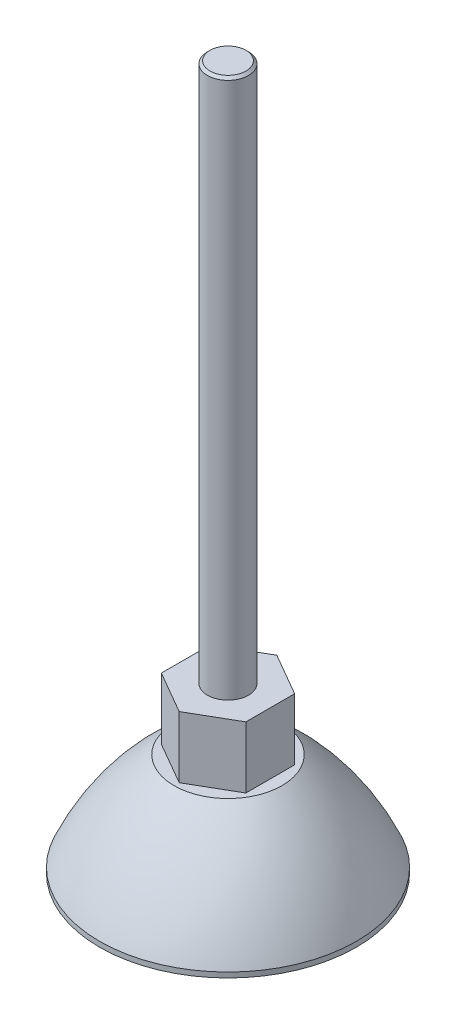
ISO-10303-21;
HEADER;
FILE_DESCRIPTION(('STEP AP214'),'2;1');
FILE_NAME('part.step','',(''),(''),'','','');
FILE_SCHEMA(('AUTOMOTIVE_DESIGN { 1 0 10303 214 1 1 1 1 }'));
ENDSEC;
DATA;
#1=APPLICATION_CONTEXT('core data for automotive mechanical design processes');
#2=APPLICATION_PROTOCOL_DEFINITION('international standard','automotive_design',2000,#1);
#3=PRODUCT_CONTEXT('',#1,'mechanical');
#4=PRODUCT('Part','Part','',(#3));
#5=PRODUCT_RELATED_PRODUCT_CATEGORY('part','',(#4));
#6=PRODUCT_DEFINITION_FORMATION('','',#4);
#7=PRODUCT_DEFINITION_CONTEXT('part definition',#1,'design');
#8=PRODUCT_DEFINITION('design','',#6,#7);
#9=PRODUCT_DEFINITION_SHAPE('','',#8);
#10=(LENGTH_UNIT() NAMED_UNIT(*) SI_UNIT(.MILLI.,.METRE.));
#11=(NAMED_UNIT(*) PLANE_ANGLE_UNIT() SI_UNIT($,.RADIAN.));
#12=(NAMED_UNIT(*) SI_UNIT($,.STERADIAN.) SOLID_ANGLE_UNIT());
#13=UNCERTAINTY_MEASURE_WITH_UNIT(LENGTH_MEASURE(1.E-05),#10,'distance_accuracy_value','');
#14=(GEOMETRIC_REPRESENTATION_CONTEXT(3) GLOBAL_UNCERTAINTY_ASSIGNED_CONTEXT((#13)) GLOBAL_UNIT_ASSIGNED_CONTEXT((#10,
#11,#12)) REPRESENTATION_CONTEXT('',''));
#15=CARTESIAN_POINT('',(0.,0.,0.));
#16=DIRECTION('',(0.,0.,1.));
#17=DIRECTION('',(1.,0.,0.));
#18=AXIS2_PLACEMENT_3D('',#15,#16,#17);
#19=CARTESIAN_POINT('',(-25.,0.,0.));
#20=DIRECTION('',(0.,1.,0.));
#21=DIRECTION('',(-1.,0.,0.));
#22=AXIS2_PLACEMENT_3D('',#19,#20,#21);
#23=PLANE('',#22);
#24=CARTESIAN_POINT('',(0.,0.,0.));
#25=DIRECTION('',(0.,-1.,0.));
#26=DIRECTION('',(1.,0.,0.));
#27=AXIS2_PLACEMENT_3D('',#24,#25,#26);
#28=CIRCLE('',#27,25.);
#29=CARTESIAN_POINT('',(25.,0.,0.));
#30=VERTEX_POINT('',#29);
#31=EDGE_CURVE('E152',#30,#30,#28,.T.);
#32=ORIENTED_EDGE('',*,*,#31,.T.);
#33=EDGE_LOOP('',(#32));
#34=FACE_BOUND('',#33,.T.);
#35=ADVANCED_FACE('F42',(#34),#23,.F.);
#36=CARTESIAN_POINT('',(0.,0.,0.));
#37=DIRECTION('',(0.,-1.,0.));
#38=DIRECTION('',(1.,0.,0.));
#39=AXIS2_PLACEMENT_3D('',#36,#37,#38);
#40=CYLINDRICAL_SURFACE('',#39,25.);
#41=ORIENTED_EDGE('',*,*,#31,.F.);
#42=EDGE_LOOP('',(#41));
#43=FACE_BOUND('',#42,.T.);
#44=CARTESIAN_POINT('',(0.,0.999999999999999,0.));
#45=DIRECTION('',(0.,-1.,0.));
#46=DIRECTION('',(1.,0.,0.));
#47=AXIS2_PLACEMENT_3D('',#44,#45,#46);
#48=CIRCLE('',#47,25.);
#49=CARTESIAN_POINT('',(25.,0.999999999999998,0.));
#50=VERTEX_POINT('',#49);
#51=EDGE_CURVE('E149',#50,#50,#48,.T.);
#52=ORIENTED_EDGE('',*,*,#51,.T.);
#53=EDGE_LOOP('',(#52));
#54=FACE_BOUND('',#53,.T.);
#55=ADVANCED_FACE('F173',(#43,#54),#40,.T.);
#56=CARTESIAN_POINT('',(0.,-18.9545207231156,0.));
#57=DIRECTION('',(0.,-1.,0.));
#58=DIRECTION('',(1.,0.,0.));
#59=AXIS2_PLACEMENT_3D('',#56,#57,#58);
#60=DEGENERATE_TOROIDAL_SURFACE('',#59,20.8455788785653,50.,.F.);
#61=ORIENTED_EDGE('',*,*,#51,.F.);
#62=EDGE_LOOP('',(#61));
#63=FACE_BOUND('',#62,.T.);
#64=CARTESIAN_POINT('',(0.,20.,0.));
#65=DIRECTION('',(0.,-1.,0.));
#66=DIRECTION('',(1.,0.,0.));
#67=AXIS2_PLACEMENT_3D('',#64,#65,#66);
#68=CIRCLE('',#67,10.5);
#69=CARTESIAN_POINT('',(10.5,20.,0.));
#70=VERTEX_POINT('',#69);
#71=EDGE_CURVE('E146',#70,#70,#68,.T.);
#72=ORIENTED_EDGE('',*,*,#71,.T.);
#73=EDGE_LOOP('',(#72));
#74=FACE_BOUND('',#73,.T.);
#75=ADVANCED_FACE('F178',(#63,#74),#60,.F.);
#76=CARTESIAN_POINT('',(-9.5,20.,0.));
#77=DIRECTION('',(0.,-1.,0.));
#78=DIRECTION('',(1.,0.,0.));
#79=AXIS2_PLACEMENT_3D('',#76,#77,#78);
#80=PLANE('',#79);
#81=ORIENTED_EDGE('',*,*,#71,.F.);
#82=EDGE_LOOP('',(#81));
#83=FACE_BOUND('',#82,.T.);
#84=DIRECTION('',(0.,0.,-1.));
#85=VECTOR('',#84,1.);
#86=CARTESIAN_POINT('',(8.22724133595221,20.,4.74999999999992));
#87=LINE('',#86,#85);
#88=CARTESIAN_POINT('',(8.22724133595221,20.,4.74999999999992));
#89=VERTEX_POINT('',#88);
#90=CARTESIAN_POINT('',(8.22724133595211,20.,-4.7500000000001));
#91=VERTEX_POINT('',#90);
#92=EDGE_CURVE('E119',#89,#91,#87,.T.);
#93=ORIENTED_EDGE('',*,*,#92,.F.);
#94=DIRECTION('',(0.866025403784435,0.,-0.500000000000007));
#95=VECTOR('',#94,1.);
#96=CARTESIAN_POINT('',(0.,20.,9.5));
#97=LINE('',#96,#95);
#98=CARTESIAN_POINT('',(0.,20.,9.5));
#99=VERTEX_POINT('',#98);
#100=EDGE_CURVE('E58',#99,#89,#97,.T.);
#101=ORIENTED_EDGE('',*,*,#100,.F.);
#102=DIRECTION('',(0.866025403784442,0.,0.499999999999995));
#103=VECTOR('',#102,1.);
#104=CARTESIAN_POINT('',(-8.22724133595215,20.,4.75000000000004));
#105=LINE('',#104,#103);
#106=CARTESIAN_POINT('',(-8.22724133595215,20.,4.75000000000004));
#107=VERTEX_POINT('',#106);
#108=EDGE_CURVE('E128',#107,#99,#105,.T.);
#109=ORIENTED_EDGE('',*,*,#108,.F.);
#110=DIRECTION('',(0.,0.,1.));
#111=VECTOR('',#110,1.);
#112=CARTESIAN_POINT('',(-8.22724133595218,20.,-4.74999999999998));
#113=LINE('',#112,#111);
#114=CARTESIAN_POINT('',(-8.22724133595218,20.,-4.74999999999998));
#115=VERTEX_POINT('',#114);
#116=EDGE_CURVE('E114',#115,#107,#113,.T.);
#117=ORIENTED_EDGE('',*,*,#116,.F.);
#118=DIRECTION('',(-0.866025403784438,0.,0.500000000000001));
#119=VECTOR('',#118,1.);
#120=CARTESIAN_POINT('',(0.,20.,-9.5));
#121=LINE('',#120,#119);
#122=CARTESIAN_POINT('',(0.,20.,-9.5));
#123=VERTEX_POINT('',#122);
#124=EDGE_CURVE('E99',#123,#115,#121,.T.);
#125=ORIENTED_EDGE('',*,*,#124,.F.);
#126=DIRECTION('',(-0.866025403784442,0.,-0.499999999999995));
#127=VECTOR('',#126,1.);
#128=CARTESIAN_POINT('',(8.22724133595211,20.,-4.7500000000001));
#129=LINE('',#128,#127);
#130=EDGE_CURVE('E111',#91,#123,#129,.T.);
#131=ORIENTED_EDGE('',*,*,#130,.F.);
#132=EDGE_LOOP('',(#93,#101,#109,#117,#125,#131));
#133=FACE_BOUND('',#132,.T.);
#134=ADVANCED_FACE('F110',(#83,#133),#80,.F.);
#135=CARTESIAN_POINT('',(8.22724133595211,-50.7106781186548,-4.7500000000001));
#136=DIRECTION('',(0.499999999999995,0.,-0.866025403784442));
#137=DIRECTION('',(-0.866025403784442,0.,-0.499999999999995));
#138=AXIS2_PLACEMENT_3D('',#135,#136,#137);
#139=PLANE('',#138);
#140=ORIENTED_EDGE('',*,*,#130,.T.);
#141=DIRECTION('',(0.,1.,0.));
#142=VECTOR('',#141,1.);
#143=CARTESIAN_POINT('',(0.,-50.7106781186548,-9.5));
#144=LINE('',#143,#142);
#145=CARTESIAN_POINT('',(0.,32.,-9.5));
#146=VERTEX_POINT('',#145);
#147=EDGE_CURVE('E96',#123,#146,#144,.T.);
#148=ORIENTED_EDGE('',*,*,#147,.T.);
#149=DIRECTION('',(-0.866025403784442,0.,-0.499999999999995));
#150=VECTOR('',#149,1.);
#151=CARTESIAN_POINT('',(8.22724133595211,32.,-4.7500000000001));
#152=LINE('',#151,#150);
#153=CARTESIAN_POINT('',(8.22724133595211,32.,-4.7500000000001));
#154=VERTEX_POINT('',#153);
#155=EDGE_CURVE('E123',#154,#146,#152,.T.);
#156=ORIENTED_EDGE('',*,*,#155,.F.);
#157=DIRECTION('',(0.,1.,0.));
#158=VECTOR('',#157,1.);
#159=CARTESIAN_POINT('',(8.22724133595211,-50.7106781186548,-4.7500000000001));
#160=LINE('',#159,#158);
#161=EDGE_CURVE('E117',#91,#154,#160,.T.);
#162=ORIENTED_EDGE('',*,*,#161,.F.);
#163=EDGE_LOOP('',(#140,#148,#156,#162));
#164=FACE_BOUND('',#163,.T.);
#165=ADVANCED_FACE('F116',(#164),#139,.T.);
#166=CARTESIAN_POINT('',(8.22724133595221,-50.7106781186548,4.74999999999992));
#167=DIRECTION('',(1.,0.,0.));
#168=DIRECTION('',(0.,0.,-1.));
#169=AXIS2_PLACEMENT_3D('',#166,#167,#168);
#170=PLANE('',#169);
#171=ORIENTED_EDGE('',*,*,#92,.T.);
#172=ORIENTED_EDGE('',*,*,#161,.T.);
#173=DIRECTION('',(0.,0.,-1.));
#174=VECTOR('',#173,1.);
#175=CARTESIAN_POINT('',(8.22724133595221,32.,4.74999999999992));
#176=LINE('',#175,#174);
#177=CARTESIAN_POINT('',(8.22724133595221,32.,4.74999999999992));
#178=VERTEX_POINT('',#177);
#179=EDGE_CURVE('E135',#178,#154,#176,.T.);
#180=ORIENTED_EDGE('',*,*,#179,.F.);
#181=DIRECTION('',(0.,1.,0.));
#182=VECTOR('',#181,1.);
#183=CARTESIAN_POINT('',(8.22724133595221,-50.7106781186548,4.74999999999992));
#184=LINE('',#183,#182);
#185=EDGE_CURVE('E133',#89,#178,#184,.T.);
#186=ORIENTED_EDGE('',*,*,#185,.F.);
#187=EDGE_LOOP('',(#171,#172,#180,#186));
#188=FACE_BOUND('',#187,.T.);
#189=ADVANCED_FACE('F193',(#188),#170,.T.);
#190=CARTESIAN_POINT('',(0.,-50.7106781186548,9.5));
#191=DIRECTION('',(0.500000000000007,0.,0.866025403784435));
#192=DIRECTION('',(0.866025403784435,0.,-0.500000000000007));
#193=AXIS2_PLACEMENT_3D('',#190,#191,#192);
#194=PLANE('',#193);
#195=ORIENTED_EDGE('',*,*,#100,.T.);
#196=ORIENTED_EDGE('',*,*,#185,.T.);
#197=DIRECTION('',(0.866025403784435,0.,-0.500000000000007));
#198=VECTOR('',#197,1.);
#199=CARTESIAN_POINT('',(0.,32.,9.5));
#200=LINE('',#199,#198);
#201=CARTESIAN_POINT('',(0.,32.,9.5));
#202=VERTEX_POINT('',#201);
#203=EDGE_CURVE('E138',#202,#178,#200,.T.);
#204=ORIENTED_EDGE('',*,*,#203,.F.);
#205=DIRECTION('',(0.,1.,0.));
#206=VECTOR('',#205,1.);
#207=CARTESIAN_POINT('',(0.,-50.7106781186548,9.5));
#208=LINE('',#207,#206);
#209=EDGE_CURVE('E136',#99,#202,#208,.T.);
#210=ORIENTED_EDGE('',*,*,#209,.F.);
#211=EDGE_LOOP('',(#195,#196,#204,#210));
#212=FACE_BOUND('',#211,.T.);
#213=ADVANCED_FACE('F196',(#212),#194,.T.);
#214=CARTESIAN_POINT('',(-8.22724133595215,-50.7106781186548,4.75000000000004));
#215=DIRECTION('',(-0.499999999999995,0.,0.866025403784442));
#216=DIRECTION('',(0.866025403784442,0.,0.499999999999995));
#217=AXIS2_PLACEMENT_3D('',#214,#215,#216);
#218=PLANE('',#217);
#219=ORIENTED_EDGE('',*,*,#108,.T.);
#220=ORIENTED_EDGE('',*,*,#209,.T.);
#221=DIRECTION('',(0.866025403784442,0.,0.499999999999995));
#222=VECTOR('',#221,1.);
#223=CARTESIAN_POINT('',(-8.22724133595214,32.,4.75000000000004));
#224=LINE('',#223,#222);
#225=CARTESIAN_POINT('',(-8.22724133595214,32.,4.75000000000004));
#226=VERTEX_POINT('',#225);
#227=EDGE_CURVE('E141',#226,#202,#224,.T.);
#228=ORIENTED_EDGE('',*,*,#227,.F.);
#229=DIRECTION('',(0.,1.,0.));
#230=VECTOR('',#229,1.);
#231=CARTESIAN_POINT('',(-8.22724133595215,-50.7106781186548,4.75000000000004));
#232=LINE('',#231,#230);
#233=EDGE_CURVE('E139',#107,#226,#232,.T.);
#234=ORIENTED_EDGE('',*,*,#233,.F.);
#235=EDGE_LOOP('',(#219,#220,#228,#234));
#236=FACE_BOUND('',#235,.T.);
#237=ADVANCED_FACE('F200',(#236),#218,.T.);
#238=CARTESIAN_POINT('',(-8.22724133595218,-50.7106781186548,-4.74999999999998));
#239=DIRECTION('',(-1.,0.,0.));
#240=DIRECTION('',(0.,0.,1.));
#241=AXIS2_PLACEMENT_3D('',#238,#239,#240);
#242=PLANE('',#241);
#243=ORIENTED_EDGE('',*,*,#116,.T.);
#244=ORIENTED_EDGE('',*,*,#233,.T.);
#245=DIRECTION('',(0.,0.,1.));
#246=VECTOR('',#245,1.);
#247=CARTESIAN_POINT('',(-8.22724133595218,32.,-4.74999999999998));
#248=LINE('',#247,#246);
#249=CARTESIAN_POINT('',(-8.22724133595217,32.,-4.74999999999998));
#250=VERTEX_POINT('',#249);
#251=EDGE_CURVE('E66',#250,#226,#248,.T.);
#252=ORIENTED_EDGE('',*,*,#251,.F.);
#253=DIRECTION('',(0.,1.,0.));
#254=VECTOR('',#253,1.);
#255=CARTESIAN_POINT('',(-8.22724133595218,-50.7106781186548,-4.74999999999998));
#256=LINE('',#255,#254);
#257=EDGE_CURVE('E142',#115,#250,#256,.T.);
#258=ORIENTED_EDGE('',*,*,#257,.F.);
#259=EDGE_LOOP('',(#243,#244,#252,#258));
#260=FACE_BOUND('',#259,.T.);
#261=ADVANCED_FACE('F203',(#260),#242,.T.);
#262=CARTESIAN_POINT('',(0.,-50.7106781186548,-9.5));
#263=DIRECTION('',(-0.500000000000001,0.,-0.866025403784438));
#264=DIRECTION('',(-0.866025403784438,0.,0.500000000000001));
#265=AXIS2_PLACEMENT_3D('',#262,#263,#264);
#266=PLANE('',#265);
#267=ORIENTED_EDGE('',*,*,#124,.T.);
#268=ORIENTED_EDGE('',*,*,#257,.T.);
#269=DIRECTION('',(-0.866025403784438,0.,0.500000000000001));
#270=VECTOR('',#269,1.);
#271=CARTESIAN_POINT('',(0.,32.,-9.5));
#272=LINE('',#271,#270);
#273=EDGE_CURVE('E101',#146,#250,#272,.T.);
#274=ORIENTED_EDGE('',*,*,#273,.F.);
#275=ORIENTED_EDGE('',*,*,#147,.F.);
#276=EDGE_LOOP('',(#267,#268,#274,#275));
#277=FACE_BOUND('',#276,.T.);
#278=ADVANCED_FACE('F98',(#277),#266,.T.);
#279=CARTESIAN_POINT('',(0.,137.,0.));
#280=DIRECTION('',(0.,-1.,0.));
#281=DIRECTION('',(1.,0.,0.));
#282=AXIS2_PLACEMENT_3D('',#279,#280,#281);
#283=PLANE('',#282);
#284=CARTESIAN_POINT('',(0.,137.,0.));
#285=DIRECTION('',(0.,-1.,0.));
#286=DIRECTION('',(1.,0.,0.));
#287=AXIS2_PLACEMENT_3D('',#284,#285,#286);
#288=CIRCLE('',#287,3.49999999999998);
#289=CARTESIAN_POINT('',(3.49999999999998,137.,0.));
#290=VERTEX_POINT('',#289);
#291=EDGE_CURVE('E11',#290,#290,#288,.F.);
#292=ORIENTED_EDGE('',*,*,#291,.T.);
#293=EDGE_LOOP('',(#292));
#294=FACE_BOUND('',#293,.T.);
#295=ADVANCED_FACE('F161',(#294),#283,.F.);
#296=CARTESIAN_POINT('',(0.,136.5,0.));
#297=DIRECTION('',(0.,-1.,0.));
#298=DIRECTION('',(1.,0.,0.));
#299=AXIS2_PLACEMENT_3D('',#296,#297,#298);
#300=CONICAL_SURFACE('',#299,4.,0.785398163397473);
#301=ORIENTED_EDGE('',*,*,#291,.F.);
#302=EDGE_LOOP('',(#301));
#303=FACE_BOUND('',#302,.T.);
#304=CARTESIAN_POINT('',(0.,136.5,0.));
#305=DIRECTION('',(0.,-1.,0.));
#306=DIRECTION('',(1.,0.,0.));
#307=AXIS2_PLACEMENT_3D('',#304,#305,#306);
#308=CIRCLE('',#307,4.);
#309=CARTESIAN_POINT('',(4.00000000000001,136.5,0.));
#310=VERTEX_POINT('',#309);
#311=EDGE_CURVE('E51',#310,#310,#308,.T.);
#312=ORIENTED_EDGE('',*,*,#311,.F.);
#313=EDGE_LOOP('',(#312));
#314=FACE_BOUND('',#313,.T.);
#315=ADVANCED_FACE('F45',(#303,#314),#300,.T.);
#316=CARTESIAN_POINT('',(0.,0.,0.));
#317=DIRECTION('',(0.,-1.,0.));
#318=DIRECTION('',(1.,0.,0.));
#319=AXIS2_PLACEMENT_3D('',#316,#317,#318);
#320=CYLINDRICAL_SURFACE('',#319,4.);
#321=ORIENTED_EDGE('',*,*,#311,.T.);
#322=EDGE_LOOP('',(#321));
#323=FACE_BOUND('',#322,.T.);
#324=CARTESIAN_POINT('',(0.,32.,0.));
#325=DIRECTION('',(0.,-1.,0.));
#326=DIRECTION('',(1.,0.,0.));
#327=AXIS2_PLACEMENT_3D('',#324,#325,#326);
#328=CIRCLE('',#327,4.);
#329=CARTESIAN_POINT('',(4.,32.,0.));
#330=VERTEX_POINT('',#329);
#331=EDGE_CURVE('E127',#330,#330,#328,.T.);
#332=ORIENTED_EDGE('',*,*,#331,.F.);
#333=EDGE_LOOP('',(#332));
#334=FACE_BOUND('',#333,.T.);
#335=ADVANCED_FACE('F157',(#323,#334),#320,.T.);
#336=CARTESIAN_POINT('',(-4.,32.,0.));
#337=DIRECTION('',(0.,-1.,0.));
#338=DIRECTION('',(1.,0.,0.));
#339=AXIS2_PLACEMENT_3D('',#336,#337,#338);
#340=PLANE('',#339);
#341=ORIENTED_EDGE('',*,*,#331,.T.);
#342=EDGE_LOOP('',(#341));
#343=FACE_BOUND('',#342,.T.);
#344=ORIENTED_EDGE('',*,*,#155,.T.);
#345=ORIENTED_EDGE('',*,*,#273,.T.);
#346=ORIENTED_EDGE('',*,*,#251,.T.);
#347=ORIENTED_EDGE('',*,*,#227,.T.);
#348=ORIENTED_EDGE('',*,*,#203,.T.);
#349=ORIENTED_EDGE('',*,*,#179,.T.);
#350=EDGE_LOOP('',(#344,#345,#346,#347,#348,#349));
#351=FACE_BOUND('',#350,.T.);
#352=ADVANCED_FACE('F167',(#343,#351),#340,.F.);
#353=CLOSED_SHELL('',(#35,#55,#75,#134,#165,#189,#213,#237,#261,#278,#295,#315,#335,#352));
#354=MANIFOLD_SOLID_BREP('B2',#353);
#355=ADVANCED_BREP_SHAPE_REPRESENTATION('',(#18,#354),#14);
#356=SHAPE_DEFINITION_REPRESENTATION(#9,#355);
ENDSEC;
END-ISO-10303-21;
